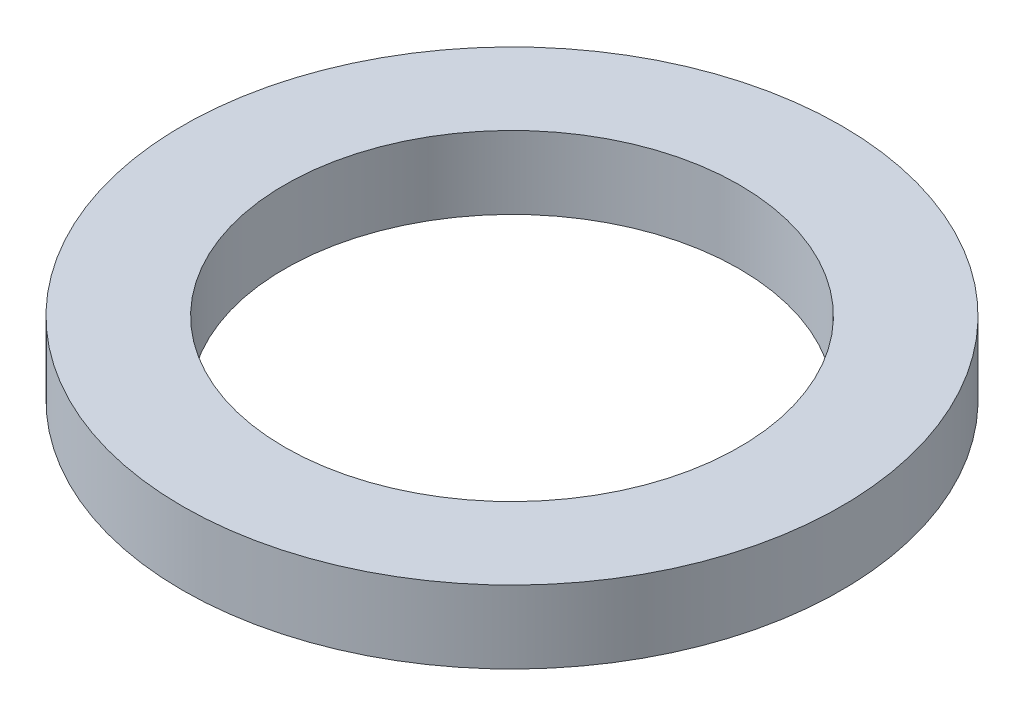
ISO-10303-21;
HEADER;
FILE_DESCRIPTION(('STEP AP214'),'2;1');
FILE_NAME('part.step','',(''),(''),'','','');
FILE_SCHEMA(('AUTOMOTIVE_DESIGN { 1 0 10303 214 1 1 1 1 }'));
ENDSEC;
DATA;
#1=APPLICATION_CONTEXT('core data for automotive mechanical design processes');
#2=APPLICATION_PROTOCOL_DEFINITION('international standard','automotive_design',2000,#1);
#3=PRODUCT_CONTEXT('',#1,'mechanical');
#4=PRODUCT('Part','Part','',(#3));
#5=PRODUCT_RELATED_PRODUCT_CATEGORY('part','',(#4));
#6=PRODUCT_DEFINITION_FORMATION('','',#4);
#7=PRODUCT_DEFINITION_CONTEXT('part definition',#1,'design');
#8=PRODUCT_DEFINITION('design','',#6,#7);
#9=PRODUCT_DEFINITION_SHAPE('','',#8);
#10=(LENGTH_UNIT() NAMED_UNIT(*) SI_UNIT(.MILLI.,.METRE.));
#11=(NAMED_UNIT(*) PLANE_ANGLE_UNIT() SI_UNIT($,.RADIAN.));
#12=(NAMED_UNIT(*) SI_UNIT($,.STERADIAN.) SOLID_ANGLE_UNIT());
#13=UNCERTAINTY_MEASURE_WITH_UNIT(LENGTH_MEASURE(1.E-05),#10,'distance_accuracy_value','');
#14=(GEOMETRIC_REPRESENTATION_CONTEXT(3) GLOBAL_UNCERTAINTY_ASSIGNED_CONTEXT((#13)) GLOBAL_UNIT_ASSIGNED_CONTEXT((#10,
#11,#12)) REPRESENTATION_CONTEXT('',''));
#15=CARTESIAN_POINT('',(0.,0.,0.));
#16=DIRECTION('',(0.,0.,1.));
#17=DIRECTION('',(1.,0.,0.));
#18=AXIS2_PLACEMENT_3D('',#15,#16,#17);
#19=CARTESIAN_POINT('',(0.,16.,0.));
#20=DIRECTION('',(0.,-1.,0.));
#21=DIRECTION('',(0.,0.,-1.));
#22=AXIS2_PLACEMENT_3D('',#19,#20,#21);
#23=CYLINDRICAL_SURFACE('',#22,72.5);
#24=CARTESIAN_POINT('',(0.,16.,0.));
#25=DIRECTION('',(0.,1.,0.));
#26=DIRECTION('',(0.,0.,1.));
#27=AXIS2_PLACEMENT_3D('',#24,#25,#26);
#28=CIRCLE('',#27,72.5);
#29=CARTESIAN_POINT('',(0.,16.,72.5));
#30=VERTEX_POINT('',#29);
#31=EDGE_CURVE('E10',#30,#30,#28,.T.);
#32=ORIENTED_EDGE('',*,*,#31,.F.);
#33=EDGE_LOOP('',(#32));
#34=FACE_BOUND('',#33,.T.);
#35=CARTESIAN_POINT('',(0.,0.,0.));
#36=DIRECTION('',(0.,1.,0.));
#37=DIRECTION('',(0.,0.,1.));
#38=AXIS2_PLACEMENT_3D('',#35,#36,#37);
#39=CIRCLE('',#38,72.5);
#40=CARTESIAN_POINT('',(0.,0.,72.5));
#41=VERTEX_POINT('',#40);
#42=EDGE_CURVE('E37',#41,#41,#39,.T.);
#43=ORIENTED_EDGE('',*,*,#42,.T.);
#44=EDGE_LOOP('',(#43));
#45=FACE_BOUND('',#44,.T.);
#46=ADVANCED_FACE('F40',(#34,#45),#23,.T.);
#47=CARTESIAN_POINT('',(0.,16.,0.));
#48=DIRECTION('',(0.,1.,0.));
#49=DIRECTION('',(0.,0.,1.));
#50=AXIS2_PLACEMENT_3D('',#47,#48,#49);
#51=PLANE('',#50);
#52=CARTESIAN_POINT('',(0.,16.,0.));
#53=DIRECTION('',(0.,1.,0.));
#54=DIRECTION('',(0.,0.,1.));
#55=AXIS2_PLACEMENT_3D('',#52,#53,#54);
#56=CIRCLE('',#55,50.);
#57=CARTESIAN_POINT('',(0.,16.,50.));
#58=VERTEX_POINT('',#57);
#59=EDGE_CURVE('E50',#58,#58,#56,.T.);
#60=ORIENTED_EDGE('',*,*,#59,.F.);
#61=EDGE_LOOP('',(#60));
#62=FACE_BOUND('',#61,.T.);
#63=ORIENTED_EDGE('',*,*,#31,.T.);
#64=EDGE_LOOP('',(#63));
#65=FACE_BOUND('',#64,.T.);
#66=ADVANCED_FACE('F59',(#62,#65),#51,.T.);
#67=CARTESIAN_POINT('',(0.,0.,0.));
#68=DIRECTION('',(0.,1.,0.));
#69=DIRECTION('',(0.,0.,1.));
#70=AXIS2_PLACEMENT_3D('',#67,#68,#69);
#71=PLANE('',#70);
#72=CARTESIAN_POINT('',(0.,0.,0.));
#73=DIRECTION('',(0.,1.,0.));
#74=DIRECTION('',(0.,0.,1.));
#75=AXIS2_PLACEMENT_3D('',#72,#73,#74);
#76=CIRCLE('',#75,50.);
#77=CARTESIAN_POINT('',(0.,0.,50.));
#78=VERTEX_POINT('',#77);
#79=EDGE_CURVE('E47',#78,#78,#76,.T.);
#80=ORIENTED_EDGE('',*,*,#79,.T.);
#81=EDGE_LOOP('',(#80));
#82=FACE_BOUND('',#81,.T.);
#83=ORIENTED_EDGE('',*,*,#42,.F.);
#84=EDGE_LOOP('',(#83));
#85=FACE_BOUND('',#84,.T.);
#86=ADVANCED_FACE('F58',(#82,#85),#71,.F.);
#87=CARTESIAN_POINT('',(0.,16.,0.));
#88=DIRECTION('',(0.,-1.,0.));
#89=DIRECTION('',(0.,0.,-1.));
#90=AXIS2_PLACEMENT_3D('',#87,#88,#89);
#91=CYLINDRICAL_SURFACE('',#90,50.);
#92=ORIENTED_EDGE('',*,*,#59,.T.);
#93=EDGE_LOOP('',(#92));
#94=FACE_BOUND('',#93,.T.);
#95=ORIENTED_EDGE('',*,*,#79,.F.);
#96=EDGE_LOOP('',(#95));
#97=FACE_BOUND('',#96,.T.);
#98=ADVANCED_FACE('F54',(#94,#97),#91,.F.);
#99=CLOSED_SHELL('',(#46,#66,#86,#98));
#100=MANIFOLD_SOLID_BREP('B2',#99);
#101=ADVANCED_BREP_SHAPE_REPRESENTATION('',(#18,#100),#14);
#102=SHAPE_DEFINITION_REPRESENTATION(#9,#101);
ENDSEC;
END-ISO-10303-21;
